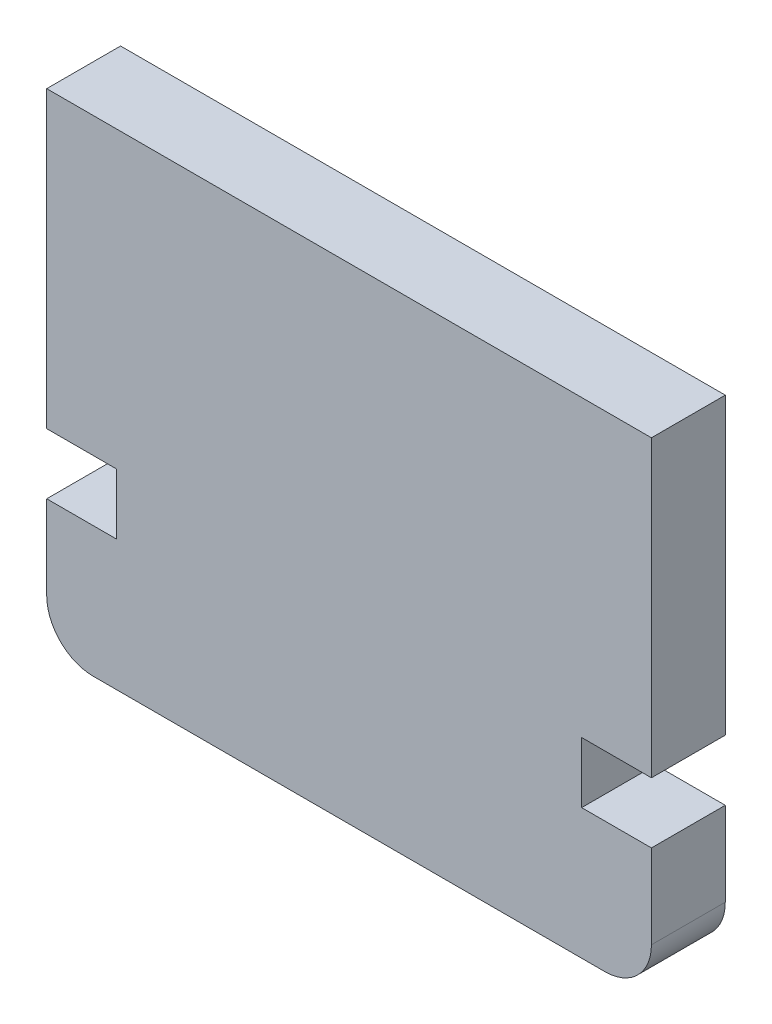
ISO-10303-21;
HEADER;
FILE_DESCRIPTION(('STEP AP214'),'2;1');
FILE_NAME('part.step','',(''),(''),'','','');
FILE_SCHEMA(('AUTOMOTIVE_DESIGN { 1 0 10303 214 1 1 1 1 }'));
ENDSEC;
DATA;
#1=APPLICATION_CONTEXT('core data for automotive mechanical design processes');
#2=APPLICATION_PROTOCOL_DEFINITION('international standard','automotive_design',2000,#1);
#3=PRODUCT_CONTEXT('',#1,'mechanical');
#4=PRODUCT('Part','Part','',(#3));
#5=PRODUCT_RELATED_PRODUCT_CATEGORY('part','',(#4));
#6=PRODUCT_DEFINITION_FORMATION('','',#4);
#7=PRODUCT_DEFINITION_CONTEXT('part definition',#1,'design');
#8=PRODUCT_DEFINITION('design','',#6,#7);
#9=PRODUCT_DEFINITION_SHAPE('','',#8);
#10=(LENGTH_UNIT() NAMED_UNIT(*) SI_UNIT(.MILLI.,.METRE.));
#11=(NAMED_UNIT(*) PLANE_ANGLE_UNIT() SI_UNIT($,.RADIAN.));
#12=(NAMED_UNIT(*) SI_UNIT($,.STERADIAN.) SOLID_ANGLE_UNIT());
#13=UNCERTAINTY_MEASURE_WITH_UNIT(LENGTH_MEASURE(1.E-05),#10,'distance_accuracy_value','');
#14=(GEOMETRIC_REPRESENTATION_CONTEXT(3) GLOBAL_UNCERTAINTY_ASSIGNED_CONTEXT((#13)) GLOBAL_UNIT_ASSIGNED_CONTEXT((#10,
#11,#12)) REPRESENTATION_CONTEXT('',''));
#15=CARTESIAN_POINT('',(0.,0.,0.));
#16=DIRECTION('',(0.,0.,1.));
#17=DIRECTION('',(1.,0.,0.));
#18=AXIS2_PLACEMENT_3D('',#15,#16,#17);
#19=CARTESIAN_POINT('',(-27.95,18.6250000000001,3.175));
#20=DIRECTION('',(1.,0.,0.));
#21=DIRECTION('',(0.,0.,-1.));
#22=AXIS2_PLACEMENT_3D('',#19,#20,#21);
#23=PLANE('',#22);
#24=DIRECTION('',(0.,-1.,0.));
#25=VECTOR('',#24,1.);
#26=CARTESIAN_POINT('',(-27.95,18.6250000000001,0.));
#27=LINE('',#26,#25);
#28=CARTESIAN_POINT('',(-27.95,18.6250000000001,0.));
#29=VERTEX_POINT('',#28);
#30=CARTESIAN_POINT('',(-27.95,5.96370467450812,0.));
#31=VERTEX_POINT('',#30);
#32=EDGE_CURVE('E178',#29,#31,#27,.T.);
#33=ORIENTED_EDGE('',*,*,#32,.T.);
#34=DIRECTION('',(0.,0.,-1.));
#35=VECTOR('',#34,1.);
#36=CARTESIAN_POINT('',(-27.95,5.96370467450812,3.175));
#37=LINE('',#36,#35);
#38=CARTESIAN_POINT('',(-27.95,5.96370467450812,3.175));
#39=VERTEX_POINT('',#38);
#40=EDGE_CURVE('E11',#39,#31,#37,.T.);
#41=ORIENTED_EDGE('',*,*,#40,.F.);
#42=DIRECTION('',(0.,-1.,0.));
#43=VECTOR('',#42,1.);
#44=CARTESIAN_POINT('',(-27.95,18.6250000000001,3.175));
#45=LINE('',#44,#43);
#46=CARTESIAN_POINT('',(-27.95,18.6250000000001,3.175));
#47=VERTEX_POINT('',#46);
#48=EDGE_CURVE('E220',#47,#39,#45,.T.);
#49=ORIENTED_EDGE('',*,*,#48,.F.);
#50=DIRECTION('',(0.,0.,-1.));
#51=VECTOR('',#50,1.);
#52=CARTESIAN_POINT('',(-27.95,18.6250000000001,3.175));
#53=LINE('',#52,#51);
#54=EDGE_CURVE('E174',#47,#29,#53,.T.);
#55=ORIENTED_EDGE('',*,*,#54,.T.);
#56=EDGE_LOOP('',(#33,#41,#49,#55));
#57=FACE_BOUND('',#56,.T.);
#58=ADVANCED_FACE('F40',(#57),#23,.F.);
#59=CARTESIAN_POINT('',(-27.95,5.96370467450812,3.175));
#60=DIRECTION('',(0.,1.,0.));
#61=DIRECTION('',(0.,0.,1.));
#62=AXIS2_PLACEMENT_3D('',#59,#60,#61);
#63=PLANE('',#62);
#64=DIRECTION('',(1.,0.,0.));
#65=VECTOR('',#64,1.);
#66=CARTESIAN_POINT('',(-27.95,5.96370467450812,0.));
#67=LINE('',#66,#65);
#68=CARTESIAN_POINT('',(-24.95,5.96370467450812,0.));
#69=VERTEX_POINT('',#68);
#70=EDGE_CURVE('E182',#31,#69,#67,.T.);
#71=ORIENTED_EDGE('',*,*,#70,.T.);
#72=DIRECTION('',(0.,0.,-1.));
#73=VECTOR('',#72,1.);
#74=CARTESIAN_POINT('',(-24.95,5.96370467450812,3.175));
#75=LINE('',#74,#73);
#76=CARTESIAN_POINT('',(-24.95,5.96370467450812,3.175));
#77=VERTEX_POINT('',#76);
#78=EDGE_CURVE('E49',#77,#69,#75,.T.);
#79=ORIENTED_EDGE('',*,*,#78,.F.);
#80=DIRECTION('',(1.,0.,0.));
#81=VECTOR('',#80,1.);
#82=CARTESIAN_POINT('',(-27.95,5.96370467450812,3.175));
#83=LINE('',#82,#81);
#84=EDGE_CURVE('E118',#39,#77,#83,.T.);
#85=ORIENTED_EDGE('',*,*,#84,.F.);
#86=ORIENTED_EDGE('',*,*,#40,.T.);
#87=EDGE_LOOP('',(#71,#79,#85,#86));
#88=FACE_BOUND('',#87,.T.);
#89=ADVANCED_FACE('F336',(#88),#63,.F.);
#90=CARTESIAN_POINT('',(-24.95,5.96370467450812,3.175));
#91=DIRECTION('',(1.,0.,0.));
#92=DIRECTION('',(0.,0.,-1.));
#93=AXIS2_PLACEMENT_3D('',#90,#91,#92);
#94=PLANE('',#93);
#95=DIRECTION('',(0.,-1.,0.));
#96=VECTOR('',#95,1.);
#97=CARTESIAN_POINT('',(-24.95,5.96370467450812,0.));
#98=LINE('',#97,#96);
#99=CARTESIAN_POINT('',(-24.95,3.35329458812484,0.));
#100=VERTEX_POINT('',#99);
#101=EDGE_CURVE('E185',#69,#100,#98,.T.);
#102=ORIENTED_EDGE('',*,*,#101,.T.);
#103=DIRECTION('',(0.,0.,-1.));
#104=VECTOR('',#103,1.);
#105=CARTESIAN_POINT('',(-24.95,3.35329458812484,3.175));
#106=LINE('',#105,#104);
#107=CARTESIAN_POINT('',(-24.95,3.35329458812484,3.175));
#108=VERTEX_POINT('',#107);
#109=EDGE_CURVE('E255',#108,#100,#106,.T.);
#110=ORIENTED_EDGE('',*,*,#109,.F.);
#111=DIRECTION('',(0.,-1.,0.));
#112=VECTOR('',#111,1.);
#113=CARTESIAN_POINT('',(-24.95,5.96370467450812,3.175));
#114=LINE('',#113,#112);
#115=EDGE_CURVE('E266',#77,#108,#114,.T.);
#116=ORIENTED_EDGE('',*,*,#115,.F.);
#117=ORIENTED_EDGE('',*,*,#78,.T.);
#118=EDGE_LOOP('',(#102,#110,#116,#117));
#119=FACE_BOUND('',#118,.T.);
#120=ADVANCED_FACE('F264',(#119),#94,.F.);
#121=CARTESIAN_POINT('',(-24.95,3.35329458812484,3.175));
#122=DIRECTION('',(0.,-1.,0.));
#123=DIRECTION('',(0.,0.,-1.));
#124=AXIS2_PLACEMENT_3D('',#121,#122,#123);
#125=PLANE('',#124);
#126=DIRECTION('',(-1.,0.,0.));
#127=VECTOR('',#126,1.);
#128=CARTESIAN_POINT('',(-24.95,3.35329458812484,0.));
#129=LINE('',#128,#127);
#130=CARTESIAN_POINT('',(-27.95,3.35329458812484,0.));
#131=VERTEX_POINT('',#130);
#132=EDGE_CURVE('E188',#100,#131,#129,.T.);
#133=ORIENTED_EDGE('',*,*,#132,.T.);
#134=DIRECTION('',(0.,0.,-1.));
#135=VECTOR('',#134,1.);
#136=CARTESIAN_POINT('',(-27.95,3.35329458812484,3.175));
#137=LINE('',#136,#135);
#138=CARTESIAN_POINT('',(-27.95,3.35329458812484,3.175));
#139=VERTEX_POINT('',#138);
#140=EDGE_CURVE('E251',#139,#131,#137,.T.);
#141=ORIENTED_EDGE('',*,*,#140,.F.);
#142=DIRECTION('',(-1.,0.,0.));
#143=VECTOR('',#142,1.);
#144=CARTESIAN_POINT('',(-24.95,3.35329458812484,3.175));
#145=LINE('',#144,#143);
#146=EDGE_CURVE('E284',#108,#139,#145,.T.);
#147=ORIENTED_EDGE('',*,*,#146,.F.);
#148=ORIENTED_EDGE('',*,*,#109,.T.);
#149=EDGE_LOOP('',(#133,#141,#147,#148));
#150=FACE_BOUND('',#149,.T.);
#151=ADVANCED_FACE('F274',(#150),#125,.F.);
#152=CARTESIAN_POINT('',(-27.95,2.79500000000011,3.175));
#153=DIRECTION('',(1.,0.,0.));
#154=DIRECTION('',(0.,0.,-1.));
#155=AXIS2_PLACEMENT_3D('',#152,#153,#154);
#156=PLANE('',#155);
#157=DIRECTION('',(0.,-1.,0.));
#158=VECTOR('',#157,1.);
#159=CARTESIAN_POINT('',(-27.95,2.79500000000011,0.));
#160=LINE('',#159,#158);
#161=CARTESIAN_POINT('',(-27.95,-0.254999999999897,0.));
#162=VERTEX_POINT('',#161);
#163=EDGE_CURVE('E192',#131,#162,#160,.T.);
#164=ORIENTED_EDGE('',*,*,#163,.T.);
#165=DIRECTION('',(0.,0.,-1.));
#166=VECTOR('',#165,1.);
#167=CARTESIAN_POINT('',(-27.95,-0.254999999999897,3.175));
#168=LINE('',#167,#166);
#169=CARTESIAN_POINT('',(-27.95,-0.254999999999897,3.175));
#170=VERTEX_POINT('',#169);
#171=EDGE_CURVE('E247',#170,#162,#168,.T.);
#172=ORIENTED_EDGE('',*,*,#171,.F.);
#173=DIRECTION('',(0.,-1.,0.));
#174=VECTOR('',#173,1.);
#175=CARTESIAN_POINT('',(-27.95,3.35329458812484,3.175));
#176=LINE('',#175,#174);
#177=EDGE_CURVE('E280',#139,#170,#176,.T.);
#178=ORIENTED_EDGE('',*,*,#177,.F.);
#179=ORIENTED_EDGE('',*,*,#140,.T.);
#180=EDGE_LOOP('',(#164,#172,#178,#179));
#181=FACE_BOUND('',#180,.T.);
#182=ADVANCED_FACE('F278',(#181),#156,.F.);
#183=CARTESIAN_POINT('',(-25.95,-0.254999999999895,3.175));
#184=DIRECTION('',(0.,0.,-1.));
#185=DIRECTION('',(-1.,0.,0.));
#186=AXIS2_PLACEMENT_3D('',#183,#184,#185);
#187=CYLINDRICAL_SURFACE('',#186,2.);
#188=CARTESIAN_POINT('',(-25.95,-0.254999999999895,0.));
#189=DIRECTION('',(0.,0.,1.));
#190=DIRECTION('',(1.,0.,0.));
#191=AXIS2_PLACEMENT_3D('',#188,#189,#190);
#192=CIRCLE('',#191,2.);
#193=CARTESIAN_POINT('',(-25.95,-2.2549999999999,0.));
#194=VERTEX_POINT('',#193);
#195=EDGE_CURVE('E195',#162,#194,#192,.T.);
#196=ORIENTED_EDGE('',*,*,#195,.T.);
#197=DIRECTION('',(0.,0.,-1.));
#198=VECTOR('',#197,1.);
#199=CARTESIAN_POINT('',(-25.95,-2.2549999999999,3.175));
#200=LINE('',#199,#198);
#201=CARTESIAN_POINT('',(-25.95,-2.2549999999999,3.175));
#202=VERTEX_POINT('',#201);
#203=EDGE_CURVE('E243',#202,#194,#200,.T.);
#204=ORIENTED_EDGE('',*,*,#203,.F.);
#205=CARTESIAN_POINT('',(-25.95,-0.254999999999895,3.175));
#206=DIRECTION('',(0.,0.,1.));
#207=DIRECTION('',(1.,0.,0.));
#208=AXIS2_PLACEMENT_3D('',#205,#206,#207);
#209=CIRCLE('',#208,2.);
#210=EDGE_CURVE('E283',#170,#202,#209,.T.);
#211=ORIENTED_EDGE('',*,*,#210,.F.);
#212=ORIENTED_EDGE('',*,*,#171,.T.);
#213=EDGE_LOOP('',(#196,#204,#211,#212));
#214=FACE_BOUND('',#213,.T.);
#215=ADVANCED_FACE('F349',(#214),#187,.T.);
#216=CARTESIAN_POINT('',(-25.95,-2.2549999999999,3.175));
#217=DIRECTION('',(0.,1.,0.));
#218=DIRECTION('',(-1.,0.,0.));
#219=AXIS2_PLACEMENT_3D('',#216,#217,#218);
#220=PLANE('',#219);
#221=DIRECTION('',(1.,0.,0.));
#222=VECTOR('',#221,1.);
#223=CARTESIAN_POINT('',(-25.95,-2.2549999999999,0.));
#224=LINE('',#223,#222);
#225=CARTESIAN_POINT('',(-3.94999999999998,-2.25499999999999,0.));
#226=VERTEX_POINT('',#225);
#227=EDGE_CURVE('E198',#194,#226,#224,.T.);
#228=ORIENTED_EDGE('',*,*,#227,.T.);
#229=DIRECTION('',(0.,0.,-1.));
#230=VECTOR('',#229,1.);
#231=CARTESIAN_POINT('',(-3.94999999999998,-2.25499999999999,3.175));
#232=LINE('',#231,#230);
#233=CARTESIAN_POINT('',(-3.94999999999998,-2.25499999999999,3.175));
#234=VERTEX_POINT('',#233);
#235=EDGE_CURVE('E239',#234,#226,#232,.T.);
#236=ORIENTED_EDGE('',*,*,#235,.F.);
#237=DIRECTION('',(1.,0.,0.));
#238=VECTOR('',#237,1.);
#239=CARTESIAN_POINT('',(-25.95,-2.2549999999999,3.175));
#240=LINE('',#239,#238);
#241=EDGE_CURVE('E289',#202,#234,#240,.T.);
#242=ORIENTED_EDGE('',*,*,#241,.F.);
#243=ORIENTED_EDGE('',*,*,#203,.T.);
#244=EDGE_LOOP('',(#228,#236,#242,#243));
#245=FACE_BOUND('',#244,.T.);
#246=ADVANCED_FACE('F352',(#245),#220,.F.);
#247=CARTESIAN_POINT('',(-3.95,-0.254999999999989,3.175));
#248=DIRECTION('',(0.,0.,-1.));
#249=DIRECTION('',(-1.,0.,0.));
#250=AXIS2_PLACEMENT_3D('',#247,#248,#249);
#251=CYLINDRICAL_SURFACE('',#250,2.);
#252=CARTESIAN_POINT('',(-3.95,-0.254999999999989,0.));
#253=DIRECTION('',(0.,0.,1.));
#254=DIRECTION('',(1.,0.,0.));
#255=AXIS2_PLACEMENT_3D('',#252,#253,#254);
#256=CIRCLE('',#255,2.);
#257=CARTESIAN_POINT('',(-1.95,-0.254999999999992,0.));
#258=VERTEX_POINT('',#257);
#259=EDGE_CURVE('E201',#226,#258,#256,.T.);
#260=ORIENTED_EDGE('',*,*,#259,.T.);
#261=DIRECTION('',(0.,0.,-1.));
#262=VECTOR('',#261,1.);
#263=CARTESIAN_POINT('',(-1.95,-0.254999999999992,3.175));
#264=LINE('',#263,#262);
#265=CARTESIAN_POINT('',(-1.95,-0.254999999999992,3.175));
#266=VERTEX_POINT('',#265);
#267=EDGE_CURVE('E235',#266,#258,#264,.T.);
#268=ORIENTED_EDGE('',*,*,#267,.F.);
#269=CARTESIAN_POINT('',(-3.95,-0.254999999999989,3.175));
#270=DIRECTION('',(0.,0.,1.));
#271=DIRECTION('',(1.,0.,0.));
#272=AXIS2_PLACEMENT_3D('',#269,#270,#271);
#273=CIRCLE('',#272,2.);
#274=EDGE_CURVE('E296',#234,#266,#273,.T.);
#275=ORIENTED_EDGE('',*,*,#274,.F.);
#276=ORIENTED_EDGE('',*,*,#235,.T.);
#277=EDGE_LOOP('',(#260,#268,#275,#276));
#278=FACE_BOUND('',#277,.T.);
#279=ADVANCED_FACE('F356',(#278),#251,.T.);
#280=CARTESIAN_POINT('',(-1.95,3.35329458812484,3.175));
#281=DIRECTION('',(-1.,0.,0.));
#282=DIRECTION('',(0.,0.,1.));
#283=AXIS2_PLACEMENT_3D('',#280,#281,#282);
#284=PLANE('',#283);
#285=DIRECTION('',(0.,1.,0.));
#286=VECTOR('',#285,1.);
#287=CARTESIAN_POINT('',(-1.95,3.35329458812484,0.));
#288=LINE('',#287,#286);
#289=CARTESIAN_POINT('',(-1.95,3.35329458812484,0.));
#290=VERTEX_POINT('',#289);
#291=EDGE_CURVE('E205',#258,#290,#288,.T.);
#292=ORIENTED_EDGE('',*,*,#291,.T.);
#293=DIRECTION('',(0.,0.,-1.));
#294=VECTOR('',#293,1.);
#295=CARTESIAN_POINT('',(-1.95,3.35329458812484,3.175));
#296=LINE('',#295,#294);
#297=CARTESIAN_POINT('',(-1.95,3.35329458812484,3.175));
#298=VERTEX_POINT('',#297);
#299=EDGE_CURVE('E231',#298,#290,#296,.T.);
#300=ORIENTED_EDGE('',*,*,#299,.F.);
#301=DIRECTION('',(0.,1.,0.));
#302=VECTOR('',#301,1.);
#303=CARTESIAN_POINT('',(-1.95,2.79500000000001,3.175));
#304=LINE('',#303,#302);
#305=EDGE_CURVE('E299',#266,#298,#304,.T.);
#306=ORIENTED_EDGE('',*,*,#305,.F.);
#307=ORIENTED_EDGE('',*,*,#267,.T.);
#308=EDGE_LOOP('',(#292,#300,#306,#307));
#309=FACE_BOUND('',#308,.T.);
#310=ADVANCED_FACE('F360',(#309),#284,.F.);
#311=CARTESIAN_POINT('',(-4.95,3.35329458812484,3.175));
#312=DIRECTION('',(0.,-1.,0.));
#313=DIRECTION('',(0.,0.,-1.));
#314=AXIS2_PLACEMENT_3D('',#311,#312,#313);
#315=PLANE('',#314);
#316=DIRECTION('',(-1.,0.,0.));
#317=VECTOR('',#316,1.);
#318=CARTESIAN_POINT('',(-4.95,3.35329458812484,0.));
#319=LINE('',#318,#317);
#320=CARTESIAN_POINT('',(-4.95,3.35329458812484,0.));
#321=VERTEX_POINT('',#320);
#322=EDGE_CURVE('E208',#290,#321,#319,.T.);
#323=ORIENTED_EDGE('',*,*,#322,.T.);
#324=DIRECTION('',(0.,0.,-1.));
#325=VECTOR('',#324,1.);
#326=CARTESIAN_POINT('',(-4.95,3.35329458812484,3.175));
#327=LINE('',#326,#325);
#328=CARTESIAN_POINT('',(-4.95,3.35329458812484,3.175));
#329=VERTEX_POINT('',#328);
#330=EDGE_CURVE('E227',#329,#321,#327,.T.);
#331=ORIENTED_EDGE('',*,*,#330,.F.);
#332=DIRECTION('',(-1.,0.,0.));
#333=VECTOR('',#332,1.);
#334=CARTESIAN_POINT('',(-4.95,3.35329458812484,3.175));
#335=LINE('',#334,#333);
#336=EDGE_CURVE('E302',#298,#329,#335,.T.);
#337=ORIENTED_EDGE('',*,*,#336,.F.);
#338=ORIENTED_EDGE('',*,*,#299,.T.);
#339=EDGE_LOOP('',(#323,#331,#337,#338));
#340=FACE_BOUND('',#339,.T.);
#341=ADVANCED_FACE('F317',(#340),#315,.F.);
#342=CARTESIAN_POINT('',(-4.95,5.96370467450812,3.175));
#343=DIRECTION('',(-1.,0.,0.));
#344=DIRECTION('',(0.,0.,1.));
#345=AXIS2_PLACEMENT_3D('',#342,#343,#344);
#346=PLANE('',#345);
#347=DIRECTION('',(0.,1.,0.));
#348=VECTOR('',#347,1.);
#349=CARTESIAN_POINT('',(-4.95,5.96370467450812,0.));
#350=LINE('',#349,#348);
#351=CARTESIAN_POINT('',(-4.95,5.96370467450812,0.));
#352=VERTEX_POINT('',#351);
#353=EDGE_CURVE('E211',#321,#352,#350,.T.);
#354=ORIENTED_EDGE('',*,*,#353,.T.);
#355=DIRECTION('',(0.,0.,-1.));
#356=VECTOR('',#355,1.);
#357=CARTESIAN_POINT('',(-4.95,5.96370467450812,3.175));
#358=LINE('',#357,#356);
#359=CARTESIAN_POINT('',(-4.95,5.96370467450812,3.175));
#360=VERTEX_POINT('',#359);
#361=EDGE_CURVE('E166',#360,#352,#358,.T.);
#362=ORIENTED_EDGE('',*,*,#361,.F.);
#363=DIRECTION('',(0.,1.,0.));
#364=VECTOR('',#363,1.);
#365=CARTESIAN_POINT('',(-4.95,5.96370467450812,3.175));
#366=LINE('',#365,#364);
#367=EDGE_CURVE('E155',#329,#360,#366,.T.);
#368=ORIENTED_EDGE('',*,*,#367,.F.);
#369=ORIENTED_EDGE('',*,*,#330,.T.);
#370=EDGE_LOOP('',(#354,#362,#368,#369));
#371=FACE_BOUND('',#370,.T.);
#372=ADVANCED_FACE('F321',(#371),#346,.F.);
#373=CARTESIAN_POINT('',(-1.95,5.96370467450812,3.175));
#374=DIRECTION('',(0.,1.,0.));
#375=DIRECTION('',(0.,0.,1.));
#376=AXIS2_PLACEMENT_3D('',#373,#374,#375);
#377=PLANE('',#376);
#378=DIRECTION('',(1.,0.,0.));
#379=VECTOR('',#378,1.);
#380=CARTESIAN_POINT('',(-1.95,5.96370467450812,0.));
#381=LINE('',#380,#379);
#382=CARTESIAN_POINT('',(-1.95,5.96370467450812,0.));
#383=VERTEX_POINT('',#382);
#384=EDGE_CURVE('E164',#352,#383,#381,.T.);
#385=ORIENTED_EDGE('',*,*,#384,.T.);
#386=DIRECTION('',(0.,0.,-1.));
#387=VECTOR('',#386,1.);
#388=CARTESIAN_POINT('',(-1.95,5.96370467450812,3.175));
#389=LINE('',#388,#387);
#390=CARTESIAN_POINT('',(-1.95,5.96370467450812,3.175));
#391=VERTEX_POINT('',#390);
#392=EDGE_CURVE('E161',#391,#383,#389,.T.);
#393=ORIENTED_EDGE('',*,*,#392,.F.);
#394=DIRECTION('',(1.,0.,0.));
#395=VECTOR('',#394,1.);
#396=CARTESIAN_POINT('',(-1.95,5.96370467450812,3.175));
#397=LINE('',#396,#395);
#398=EDGE_CURVE('E149',#360,#391,#397,.T.);
#399=ORIENTED_EDGE('',*,*,#398,.F.);
#400=ORIENTED_EDGE('',*,*,#361,.T.);
#401=EDGE_LOOP('',(#385,#393,#399,#400));
#402=FACE_BOUND('',#401,.T.);
#403=ADVANCED_FACE('F162',(#402),#377,.F.);
#404=CARTESIAN_POINT('',(-1.95,18.625,3.175));
#405=DIRECTION('',(-1.,0.,0.));
#406=DIRECTION('',(0.,-1.,0.));
#407=AXIS2_PLACEMENT_3D('',#404,#405,#406);
#408=PLANE('',#407);
#409=DIRECTION('',(0.,1.,0.));
#410=VECTOR('',#409,1.);
#411=CARTESIAN_POINT('',(-1.95,18.625,0.));
#412=LINE('',#411,#410);
#413=CARTESIAN_POINT('',(-1.95,18.625,0.));
#414=VERTEX_POINT('',#413);
#415=EDGE_CURVE('E104',#383,#414,#412,.T.);
#416=ORIENTED_EDGE('',*,*,#415,.T.);
#417=DIRECTION('',(0.,0.,-1.));
#418=VECTOR('',#417,1.);
#419=CARTESIAN_POINT('',(-1.95,18.625,3.175));
#420=LINE('',#419,#418);
#421=CARTESIAN_POINT('',(-1.95,18.625,3.175));
#422=VERTEX_POINT('',#421);
#423=EDGE_CURVE('E167',#422,#414,#420,.T.);
#424=ORIENTED_EDGE('',*,*,#423,.F.);
#425=DIRECTION('',(0.,1.,0.));
#426=VECTOR('',#425,1.);
#427=CARTESIAN_POINT('',(-1.95,18.625,3.175));
#428=LINE('',#427,#426);
#429=EDGE_CURVE('E153',#391,#422,#428,.T.);
#430=ORIENTED_EDGE('',*,*,#429,.F.);
#431=ORIENTED_EDGE('',*,*,#392,.T.);
#432=EDGE_LOOP('',(#416,#424,#430,#431));
#433=FACE_BOUND('',#432,.T.);
#434=ADVANCED_FACE('F169',(#433),#408,.F.);
#435=CARTESIAN_POINT('',(-27.95,18.6250000000001,3.175));
#436=DIRECTION('',(0.,-1.,0.));
#437=DIRECTION('',(1.,0.,0.));
#438=AXIS2_PLACEMENT_3D('',#435,#436,#437);
#439=PLANE('',#438);
#440=DIRECTION('',(-1.,0.,0.));
#441=VECTOR('',#440,1.);
#442=CARTESIAN_POINT('',(-27.95,18.6250000000001,0.));
#443=LINE('',#442,#441);
#444=EDGE_CURVE('E110',#414,#29,#443,.T.);
#445=ORIENTED_EDGE('',*,*,#444,.T.);
#446=ORIENTED_EDGE('',*,*,#54,.F.);
#447=DIRECTION('',(-1.,0.,0.));
#448=VECTOR('',#447,1.);
#449=CARTESIAN_POINT('',(-27.95,18.6250000000001,3.175));
#450=LINE('',#449,#448);
#451=EDGE_CURVE('E57',#422,#47,#450,.T.);
#452=ORIENTED_EDGE('',*,*,#451,.F.);
#453=ORIENTED_EDGE('',*,*,#423,.T.);
#454=EDGE_LOOP('',(#445,#446,#452,#453));
#455=FACE_BOUND('',#454,.T.);
#456=ADVANCED_FACE('F325',(#455),#439,.F.);
#457=CARTESIAN_POINT('',(-25.95,-0.254999999999895,3.175));
#458=DIRECTION('',(0.,0.,1.));
#459=DIRECTION('',(1.,0.,0.));
#460=AXIS2_PLACEMENT_3D('',#457,#458,#459);
#461=PLANE('',#460);
#462=ORIENTED_EDGE('',*,*,#48,.T.);
#463=ORIENTED_EDGE('',*,*,#84,.T.);
#464=ORIENTED_EDGE('',*,*,#115,.T.);
#465=ORIENTED_EDGE('',*,*,#146,.T.);
#466=ORIENTED_EDGE('',*,*,#177,.T.);
#467=ORIENTED_EDGE('',*,*,#210,.T.);
#468=ORIENTED_EDGE('',*,*,#241,.T.);
#469=ORIENTED_EDGE('',*,*,#274,.T.);
#470=ORIENTED_EDGE('',*,*,#305,.T.);
#471=ORIENTED_EDGE('',*,*,#336,.T.);
#472=ORIENTED_EDGE('',*,*,#367,.T.);
#473=ORIENTED_EDGE('',*,*,#398,.T.);
#474=ORIENTED_EDGE('',*,*,#429,.T.);
#475=ORIENTED_EDGE('',*,*,#451,.T.);
#476=EDGE_LOOP('',(#462,#463,#464,#465,#466,#467,#468,#469,#470,#471,#472,#473,#474,#475));
#477=FACE_BOUND('',#476,.T.);
#478=ADVANCED_FACE('F151',(#477),#461,.T.);
#479=CARTESIAN_POINT('',(-25.95,-0.254999999999895,0.));
#480=DIRECTION('',(0.,0.,1.));
#481=DIRECTION('',(1.,0.,0.));
#482=AXIS2_PLACEMENT_3D('',#479,#480,#481);
#483=PLANE('',#482);
#484=ORIENTED_EDGE('',*,*,#32,.F.);
#485=ORIENTED_EDGE('',*,*,#444,.F.);
#486=ORIENTED_EDGE('',*,*,#415,.F.);
#487=ORIENTED_EDGE('',*,*,#384,.F.);
#488=ORIENTED_EDGE('',*,*,#353,.F.);
#489=ORIENTED_EDGE('',*,*,#322,.F.);
#490=ORIENTED_EDGE('',*,*,#291,.F.);
#491=ORIENTED_EDGE('',*,*,#259,.F.);
#492=ORIENTED_EDGE('',*,*,#227,.F.);
#493=ORIENTED_EDGE('',*,*,#195,.F.);
#494=ORIENTED_EDGE('',*,*,#163,.F.);
#495=ORIENTED_EDGE('',*,*,#132,.F.);
#496=ORIENTED_EDGE('',*,*,#101,.F.);
#497=ORIENTED_EDGE('',*,*,#70,.F.);
#498=EDGE_LOOP('',(#484,#485,#486,#487,#488,#489,#490,#491,#492,#493,#494,#495,#496,#497));
#499=FACE_BOUND('',#498,.T.);
#500=ADVANCED_FACE('F270',(#499),#483,.F.);
#501=CLOSED_SHELL('',(#58,#89,#120,#151,#182,#215,#246,#279,#310,#341,#372,#403,#434,#456,#478,#500));
#502=MANIFOLD_SOLID_BREP('B2',#501);
#503=ADVANCED_BREP_SHAPE_REPRESENTATION('',(#18,#502),#14);
#504=SHAPE_DEFINITION_REPRESENTATION(#9,#503);
ENDSEC;
END-ISO-10303-21;
